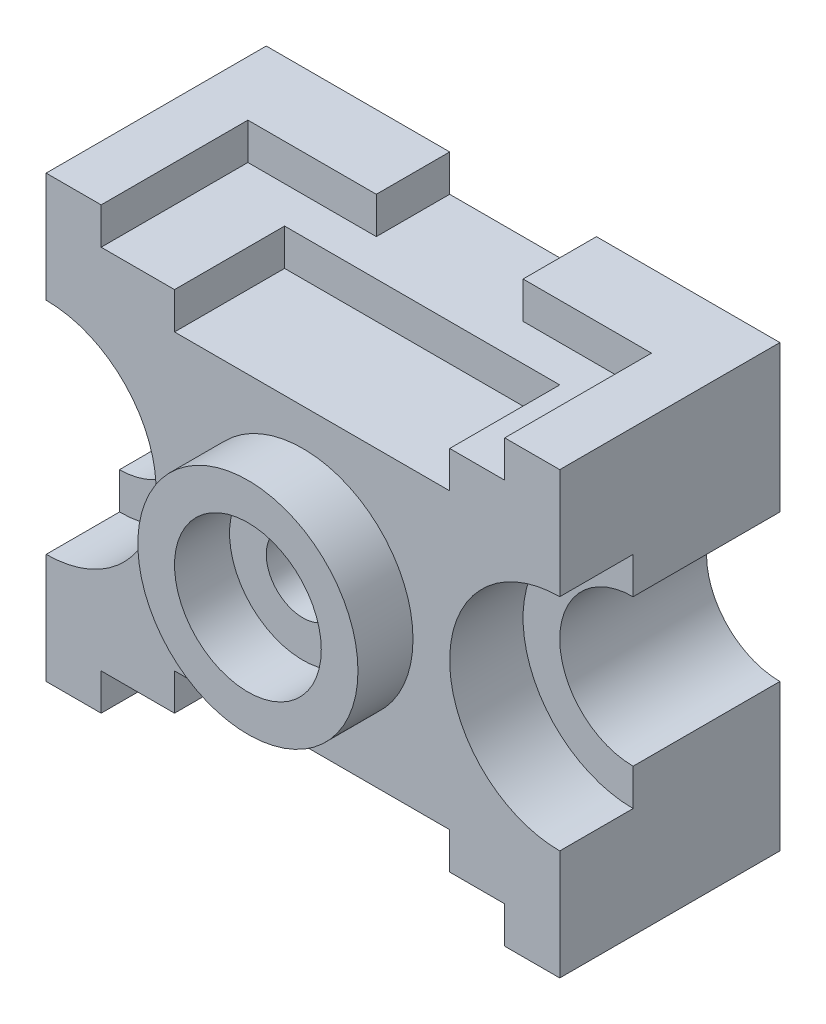
ISO-10303-21;
HEADER;
FILE_DESCRIPTION(('STEP AP214'),'2;1');
FILE_NAME('part.step','',(''),(''),'','','');
FILE_SCHEMA(('AUTOMOTIVE_DESIGN { 1 0 10303 214 1 1 1 1 }'));
ENDSEC;
DATA;
#1=APPLICATION_CONTEXT('core data for automotive mechanical design processes');
#2=APPLICATION_PROTOCOL_DEFINITION('international standard','automotive_design',2000,#1);
#3=PRODUCT_CONTEXT('',#1,'mechanical');
#4=PRODUCT('Part','Part','',(#3));
#5=PRODUCT_RELATED_PRODUCT_CATEGORY('part','',(#4));
#6=PRODUCT_DEFINITION_FORMATION('','',#4);
#7=PRODUCT_DEFINITION_CONTEXT('part definition',#1,'design');
#8=PRODUCT_DEFINITION('design','',#6,#7);
#9=PRODUCT_DEFINITION_SHAPE('','',#8);
#10=(LENGTH_UNIT() NAMED_UNIT(*) SI_UNIT(.MILLI.,.METRE.));
#11=(NAMED_UNIT(*) PLANE_ANGLE_UNIT() SI_UNIT($,.RADIAN.));
#12=(NAMED_UNIT(*) SI_UNIT($,.STERADIAN.) SOLID_ANGLE_UNIT());
#13=UNCERTAINTY_MEASURE_WITH_UNIT(LENGTH_MEASURE(1.E-05),#10,'distance_accuracy_value','');
#14=(GEOMETRIC_REPRESENTATION_CONTEXT(3) GLOBAL_UNCERTAINTY_ASSIGNED_CONTEXT((#13)) GLOBAL_UNIT_ASSIGNED_CONTEXT((#10,
#11,#12)) REPRESENTATION_CONTEXT('',''));
#15=CARTESIAN_POINT('',(0.,0.,0.));
#16=DIRECTION('',(0.,0.,1.));
#17=DIRECTION('',(1.,0.,0.));
#18=AXIS2_PLACEMENT_3D('',#15,#16,#17);
#19=CARTESIAN_POINT('',(55.,55.,0.));
#20=DIRECTION('',(1.,0.,0.));
#21=DIRECTION('',(0.,1.,0.));
#22=AXIS2_PLACEMENT_3D('',#19,#20,#21);
#23=PLANE('',#22);
#24=DIRECTION('',(0.,0.,1.));
#25=VECTOR('',#24,1.);
#26=CARTESIAN_POINT('',(55.,40.,20.));
#27=LINE('',#26,#25);
#28=CARTESIAN_POINT('',(55.,40.,20.));
#29=VERTEX_POINT('',#28);
#30=CARTESIAN_POINT('',(55.,40.,30.));
#31=VERTEX_POINT('',#30);
#32=EDGE_CURVE('E258',#29,#31,#27,.T.);
#33=ORIENTED_EDGE('',*,*,#32,.F.);
#34=DIRECTION('',(0.,1.,0.));
#35=VECTOR('',#34,1.);
#36=CARTESIAN_POINT('',(55.,10.,20.));
#37=LINE('',#36,#35);
#38=CARTESIAN_POINT('',(55.,35.,20.));
#39=VERTEX_POINT('',#38);
#40=EDGE_CURVE('E265',#39,#29,#37,.T.);
#41=ORIENTED_EDGE('',*,*,#40,.F.);
#42=DIRECTION('',(0.,0.,-1.));
#43=VECTOR('',#42,1.);
#44=CARTESIAN_POINT('',(55.,35.,20.));
#45=LINE('',#44,#43);
#46=CARTESIAN_POINT('',(55.,35.,0.));
#47=VERTEX_POINT('',#46);
#48=EDGE_CURVE('E278',#39,#47,#45,.T.);
#49=ORIENTED_EDGE('',*,*,#48,.T.);
#50=DIRECTION('',(0.,1.,0.));
#51=VECTOR('',#50,1.);
#52=CARTESIAN_POINT('',(55.,55.,0.));
#53=LINE('',#52,#51);
#54=CARTESIAN_POINT('',(55.,55.,0.));
#55=VERTEX_POINT('',#54);
#56=EDGE_CURVE('E301',#47,#55,#53,.T.);
#57=ORIENTED_EDGE('',*,*,#56,.T.);
#58=DIRECTION('',(0.,0.,1.));
#59=VECTOR('',#58,1.);
#60=CARTESIAN_POINT('',(55.,55.,0.));
#61=LINE('',#60,#59);
#62=CARTESIAN_POINT('',(55.,55.,30.));
#63=VERTEX_POINT('',#62);
#64=EDGE_CURVE('E309',#55,#63,#61,.T.);
#65=ORIENTED_EDGE('',*,*,#64,.T.);
#66=DIRECTION('',(0.,1.,0.));
#67=VECTOR('',#66,1.);
#68=CARTESIAN_POINT('',(55.,55.,30.));
#69=LINE('',#68,#67);
#70=EDGE_CURVE('E297',#31,#63,#69,.T.);
#71=ORIENTED_EDGE('',*,*,#70,.F.);
#72=EDGE_LOOP('',(#33,#41,#49,#57,#65,#71));
#73=FACE_BOUND('',#72,.T.);
#74=ADVANCED_FACE('F33',(#73),#23,.T.);
#75=CARTESIAN_POINT('',(0.,50.,30.));
#76=DIRECTION('',(0.,-1.,0.));
#77=DIRECTION('',(0.,0.,-1.));
#78=AXIS2_PLACEMENT_3D('',#75,#76,#77);
#79=PLANE('',#78);
#80=DIRECTION('',(1.,0.,0.));
#81=VECTOR('',#80,1.);
#82=CARTESIAN_POINT('',(30.,50.,10.));
#83=LINE('',#82,#81);
#84=CARTESIAN_POINT('',(30.,50.,10.));
#85=VERTEX_POINT('',#84);
#86=CARTESIAN_POINT('',(47.5,50.,10.));
#87=VERTEX_POINT('',#86);
#88=EDGE_CURVE('E281',#85,#87,#83,.T.);
#89=ORIENTED_EDGE('',*,*,#88,.F.);
#90=DIRECTION('',(0.,0.,1.));
#91=VECTOR('',#90,1.);
#92=CARTESIAN_POINT('',(30.,50.,0.));
#93=LINE('',#92,#91);
#94=CARTESIAN_POINT('',(30.,50.,0.));
#95=VERTEX_POINT('',#94);
#96=EDGE_CURVE('E287',#95,#85,#93,.T.);
#97=ORIENTED_EDGE('',*,*,#96,.F.);
#98=DIRECTION('',(1.,0.,0.));
#99=VECTOR('',#98,1.);
#100=CARTESIAN_POINT('',(0.,50.,0.));
#101=LINE('',#100,#99);
#102=CARTESIAN_POINT('',(9.99999999999999,50.,0.));
#103=VERTEX_POINT('',#102);
#104=EDGE_CURVE('E427',#103,#95,#101,.T.);
#105=ORIENTED_EDGE('',*,*,#104,.F.);
#106=DIRECTION('',(0.,0.,-1.));
#107=VECTOR('',#106,1.);
#108=CARTESIAN_POINT('',(9.99999999999999,50.,0.));
#109=LINE('',#108,#107);
#110=CARTESIAN_POINT('',(10.,50.,10.));
#111=VERTEX_POINT('',#110);
#112=EDGE_CURVE('E460',#111,#103,#109,.T.);
#113=ORIENTED_EDGE('',*,*,#112,.F.);
#114=DIRECTION('',(1.,0.,0.));
#115=VECTOR('',#114,1.);
#116=CARTESIAN_POINT('',(10.,50.,10.));
#117=LINE('',#116,#115);
#118=CARTESIAN_POINT('',(-7.50000000000001,50.,10.));
#119=VERTEX_POINT('',#118);
#120=EDGE_CURVE('E456',#119,#111,#117,.T.);
#121=ORIENTED_EDGE('',*,*,#120,.F.);
#122=DIRECTION('',(0.,0.,-1.));
#123=VECTOR('',#122,1.);
#124=CARTESIAN_POINT('',(-7.50000000000001,50.,30.));
#125=LINE('',#124,#123);
#126=CARTESIAN_POINT('',(-7.50000000000001,50.,30.));
#127=VERTEX_POINT('',#126);
#128=EDGE_CURVE('E518',#127,#119,#125,.T.);
#129=ORIENTED_EDGE('',*,*,#128,.F.);
#130=DIRECTION('',(-1.,0.,0.));
#131=VECTOR('',#130,1.);
#132=CARTESIAN_POINT('',(0.,50.,30.));
#133=LINE('',#132,#131);
#134=CARTESIAN_POINT('',(2.50000000000001,50.,30.));
#135=VERTEX_POINT('',#134);
#136=EDGE_CURVE('E450',#135,#127,#133,.T.);
#137=ORIENTED_EDGE('',*,*,#136,.F.);
#138=DIRECTION('',(0.,0.,1.));
#139=VECTOR('',#138,1.);
#140=CARTESIAN_POINT('',(2.50000000000001,50.,15.));
#141=LINE('',#140,#139);
#142=CARTESIAN_POINT('',(2.50000000000001,50.,15.));
#143=VERTEX_POINT('',#142);
#144=EDGE_CURVE('E433',#143,#135,#141,.T.);
#145=ORIENTED_EDGE('',*,*,#144,.F.);
#146=DIRECTION('',(-1.,0.,0.));
#147=VECTOR('',#146,1.);
#148=CARTESIAN_POINT('',(40.,50.,15.));
#149=LINE('',#148,#147);
#150=CARTESIAN_POINT('',(40.,50.,15.));
#151=VERTEX_POINT('',#150);
#152=EDGE_CURVE('E413',#151,#143,#149,.T.);
#153=ORIENTED_EDGE('',*,*,#152,.F.);
#154=DIRECTION('',(0.,0.,1.));
#155=VECTOR('',#154,1.);
#156=CARTESIAN_POINT('',(40.,50.,0.));
#157=LINE('',#156,#155);
#158=CARTESIAN_POINT('',(40.,50.,30.));
#159=VERTEX_POINT('',#158);
#160=EDGE_CURVE('E339',#151,#159,#157,.T.);
#161=ORIENTED_EDGE('',*,*,#160,.T.);
#162=DIRECTION('',(-1.,0.,0.));
#163=VECTOR('',#162,1.);
#164=CARTESIAN_POINT('',(40.,50.,30.));
#165=LINE('',#164,#163);
#166=CARTESIAN_POINT('',(47.5,50.,30.));
#167=VERTEX_POINT('',#166);
#168=EDGE_CURVE('E318',#167,#159,#165,.T.);
#169=ORIENTED_EDGE('',*,*,#168,.F.);
#170=DIRECTION('',(0.,0.,1.));
#171=VECTOR('',#170,1.);
#172=CARTESIAN_POINT('',(47.5,50.,0.));
#173=LINE('',#172,#171);
#174=EDGE_CURVE('E337',#87,#167,#173,.T.);
#175=ORIENTED_EDGE('',*,*,#174,.F.);
#176=EDGE_LOOP('',(#89,#97,#105,#113,#121,#129,#137,#145,#153,#161,#169,#175));
#177=FACE_BOUND('',#176,.T.);
#178=ADVANCED_FACE('F448',(#177),#79,.F.);
#179=CARTESIAN_POINT('',(47.5,50.,0.));
#180=DIRECTION('',(-1.,0.,0.));
#181=DIRECTION('',(0.,0.,1.));
#182=AXIS2_PLACEMENT_3D('',#179,#180,#181);
#183=PLANE('',#182);
#184=DIRECTION('',(0.,0.,1.));
#185=VECTOR('',#184,1.);
#186=CARTESIAN_POINT('',(47.5,55.,0.));
#187=LINE('',#186,#185);
#188=CARTESIAN_POINT('',(47.5,55.,10.));
#189=VERTEX_POINT('',#188);
#190=CARTESIAN_POINT('',(47.5,55.,30.));
#191=VERTEX_POINT('',#190);
#192=EDGE_CURVE('E335',#189,#191,#187,.T.);
#193=ORIENTED_EDGE('',*,*,#192,.F.);
#194=DIRECTION('',(0.,-1.,0.));
#195=VECTOR('',#194,1.);
#196=CARTESIAN_POINT('',(47.5,55.,10.));
#197=LINE('',#196,#195);
#198=EDGE_CURVE('E50',#189,#87,#197,.T.);
#199=ORIENTED_EDGE('',*,*,#198,.T.);
#200=ORIENTED_EDGE('',*,*,#174,.T.);
#201=DIRECTION('',(0.,-1.,0.));
#202=VECTOR('',#201,1.);
#203=CARTESIAN_POINT('',(47.5,50.,30.));
#204=LINE('',#203,#202);
#205=EDGE_CURVE('E315',#191,#167,#204,.T.);
#206=ORIENTED_EDGE('',*,*,#205,.F.);
#207=EDGE_LOOP('',(#193,#199,#200,#206));
#208=FACE_BOUND('',#207,.T.);
#209=ADVANCED_FACE('F612',(#208),#183,.T.);
#210=CARTESIAN_POINT('',(0.,0.,30.));
#211=DIRECTION('',(0.,0.,1.));
#212=DIRECTION('',(1.,0.,0.));
#213=AXIS2_PLACEMENT_3D('',#210,#211,#212);
#214=PLANE('',#213);
#215=CARTESIAN_POINT('',(55.,25.,30.));
#216=DIRECTION('',(0.,0.,1.));
#217=DIRECTION('',(1.,0.,0.));
#218=AXIS2_PLACEMENT_3D('',#215,#216,#217);
#219=CIRCLE('',#218,15.);
#220=CARTESIAN_POINT('',(55.,10.,30.));
#221=VERTEX_POINT('',#220);
#222=EDGE_CURVE('E253',#31,#221,#219,.T.);
#223=ORIENTED_EDGE('',*,*,#222,.F.);
#224=ORIENTED_EDGE('',*,*,#70,.T.);
#225=DIRECTION('',(-1.,0.,0.));
#226=VECTOR('',#225,1.);
#227=CARTESIAN_POINT('',(47.5,55.,30.));
#228=LINE('',#227,#226);
#229=EDGE_CURVE('E312',#63,#191,#228,.T.);
#230=ORIENTED_EDGE('',*,*,#229,.T.);
#231=ORIENTED_EDGE('',*,*,#205,.T.);
#232=ORIENTED_EDGE('',*,*,#168,.T.);
#233=DIRECTION('',(0.,-1.,0.));
#234=VECTOR('',#233,1.);
#235=CARTESIAN_POINT('',(40.,0.,30.));
#236=LINE('',#235,#234);
#237=CARTESIAN_POINT('',(40.,45.,30.));
#238=VERTEX_POINT('',#237);
#239=EDGE_CURVE('E330',#159,#238,#236,.T.);
#240=ORIENTED_EDGE('',*,*,#239,.T.);
#241=DIRECTION('',(1.,0.,0.));
#242=VECTOR('',#241,1.);
#243=CARTESIAN_POINT('',(2.50000000000001,45.,30.));
#244=LINE('',#243,#242);
#245=CARTESIAN_POINT('',(2.50000000000001,45.,30.));
#246=VERTEX_POINT('',#245);
#247=EDGE_CURVE('E418',#246,#238,#244,.T.);
#248=ORIENTED_EDGE('',*,*,#247,.F.);
#249=DIRECTION('',(0.,-1.,0.));
#250=VECTOR('',#249,1.);
#251=CARTESIAN_POINT('',(2.50000000000001,50.,30.));
#252=LINE('',#251,#250);
#253=EDGE_CURVE('E407',#135,#246,#252,.T.);
#254=ORIENTED_EDGE('',*,*,#253,.F.);
#255=ORIENTED_EDGE('',*,*,#136,.T.);
#256=DIRECTION('',(0.,1.,0.));
#257=VECTOR('',#256,1.);
#258=CARTESIAN_POINT('',(-7.50000000000001,50.,30.));
#259=LINE('',#258,#257);
#260=CARTESIAN_POINT('',(-7.50000000000001,55.,30.));
#261=VERTEX_POINT('',#260);
#262=EDGE_CURVE('E497',#127,#261,#259,.T.);
#263=ORIENTED_EDGE('',*,*,#262,.T.);
#264=DIRECTION('',(-1.,0.,0.));
#265=VECTOR('',#264,1.);
#266=CARTESIAN_POINT('',(-7.50000000000001,55.,30.));
#267=LINE('',#266,#265);
#268=CARTESIAN_POINT('',(-15.,55.,30.));
#269=VERTEX_POINT('',#268);
#270=EDGE_CURVE('E499',#261,#269,#267,.T.);
#271=ORIENTED_EDGE('',*,*,#270,.T.);
#272=DIRECTION('',(0.,-1.,0.));
#273=VECTOR('',#272,1.);
#274=CARTESIAN_POINT('',(-15.,55.,30.));
#275=LINE('',#274,#273);
#276=CARTESIAN_POINT('',(-15.,40.,30.));
#277=VERTEX_POINT('',#276);
#278=EDGE_CURVE('E485',#269,#277,#275,.T.);
#279=ORIENTED_EDGE('',*,*,#278,.T.);
#280=CARTESIAN_POINT('',(-15.,25.,30.));
#281=DIRECTION('',(0.,0.,1.));
#282=DIRECTION('',(-1.,0.,0.));
#283=AXIS2_PLACEMENT_3D('',#280,#281,#282);
#284=CIRCLE('',#283,15.);
#285=CARTESIAN_POINT('',(-15.,10.,30.));
#286=VERTEX_POINT('',#285);
#287=EDGE_CURVE('E365',#286,#277,#284,.T.);
#288=ORIENTED_EDGE('',*,*,#287,.F.);
#289=CARTESIAN_POINT('',(-15.,-5.,30.));
#290=VERTEX_POINT('',#289);
#291=EDGE_CURVE('E489',#286,#290,#275,.T.);
#292=ORIENTED_EDGE('',*,*,#291,.T.);
#293=DIRECTION('',(1.,0.,0.));
#294=VECTOR('',#293,1.);
#295=CARTESIAN_POINT('',(-15.,-5.,30.));
#296=LINE('',#295,#294);
#297=CARTESIAN_POINT('',(-7.5,-5.,30.));
#298=VERTEX_POINT('',#297);
#299=EDGE_CURVE('E488',#290,#298,#296,.T.);
#300=ORIENTED_EDGE('',*,*,#299,.T.);
#301=DIRECTION('',(0.,1.,0.));
#302=VECTOR('',#301,1.);
#303=CARTESIAN_POINT('',(-7.5,-5.,30.));
#304=LINE('',#303,#302);
#305=CARTESIAN_POINT('',(-7.5,0.,30.));
#306=VERTEX_POINT('',#305);
#307=EDGE_CURVE('E491',#298,#306,#304,.T.);
#308=ORIENTED_EDGE('',*,*,#307,.T.);
#309=DIRECTION('',(1.,0.,0.));
#310=VECTOR('',#309,1.);
#311=CARTESIAN_POINT('',(-7.5,0.,30.));
#312=LINE('',#311,#310);
#313=CARTESIAN_POINT('',(2.50000000000001,0.,30.));
#314=VERTEX_POINT('',#313);
#315=EDGE_CURVE('E493',#306,#314,#312,.T.);
#316=ORIENTED_EDGE('',*,*,#315,.T.);
#317=DIRECTION('',(0.,-1.,0.));
#318=VECTOR('',#317,1.);
#319=CARTESIAN_POINT('',(2.50000000000001,0.,30.));
#320=LINE('',#319,#318);
#321=CARTESIAN_POINT('',(2.50000000000001,5.,30.));
#322=VERTEX_POINT('',#321);
#323=EDGE_CURVE('E397',#322,#314,#320,.T.);
#324=ORIENTED_EDGE('',*,*,#323,.F.);
#325=DIRECTION('',(-1.,0.,0.));
#326=VECTOR('',#325,1.);
#327=CARTESIAN_POINT('',(2.50000000000001,5.,30.));
#328=LINE('',#327,#326);
#329=CARTESIAN_POINT('',(40.,5.,30.));
#330=VERTEX_POINT('',#329);
#331=EDGE_CURVE('E378',#330,#322,#328,.T.);
#332=ORIENTED_EDGE('',*,*,#331,.F.);
#333=CARTESIAN_POINT('',(40.,0.,30.));
#334=VERTEX_POINT('',#333);
#335=EDGE_CURVE('E321',#330,#334,#236,.T.);
#336=ORIENTED_EDGE('',*,*,#335,.T.);
#337=DIRECTION('',(1.,0.,0.));
#338=VECTOR('',#337,1.);
#339=CARTESIAN_POINT('',(47.5,0.,30.));
#340=LINE('',#339,#338);
#341=CARTESIAN_POINT('',(47.5,0.,30.));
#342=VERTEX_POINT('',#341);
#343=EDGE_CURVE('E324',#334,#342,#340,.T.);
#344=ORIENTED_EDGE('',*,*,#343,.T.);
#345=DIRECTION('',(0.,-1.,0.));
#346=VECTOR('',#345,1.);
#347=CARTESIAN_POINT('',(47.5,-5.,30.));
#348=LINE('',#347,#346);
#349=CARTESIAN_POINT('',(47.5,-5.,30.));
#350=VERTEX_POINT('',#349);
#351=EDGE_CURVE('E550',#342,#350,#348,.T.);
#352=ORIENTED_EDGE('',*,*,#351,.T.);
#353=DIRECTION('',(1.,0.,0.));
#354=VECTOR('',#353,1.);
#355=CARTESIAN_POINT('',(55.,-5.,30.));
#356=LINE('',#355,#354);
#357=CARTESIAN_POINT('',(55.,-5.,30.));
#358=VERTEX_POINT('',#357);
#359=EDGE_CURVE('E556',#350,#358,#356,.T.);
#360=ORIENTED_EDGE('',*,*,#359,.T.);
#361=EDGE_CURVE('E310',#358,#221,#69,.T.);
#362=ORIENTED_EDGE('',*,*,#361,.T.);
#363=EDGE_LOOP('',(#223,#224,#230,#231,#232,#240,#248,#254,#255,#263,#271,#279,#288,#292,#300,
#308,#316,#324,#332,#336,#344,#352,#360,#362));
#364=FACE_BOUND('',#363,.T.);
#365=CARTESIAN_POINT('',(20.,25.,30.));
#366=DIRECTION('',(0.,0.,1.));
#367=DIRECTION('',(1.,0.,0.));
#368=AXIS2_PLACEMENT_3D('',#365,#366,#367);
#369=CIRCLE('',#368,15.);
#370=CARTESIAN_POINT('',(35.,25.,30.));
#371=VERTEX_POINT('',#370);
#372=EDGE_CURVE('E359',#371,#371,#369,.T.);
#373=ORIENTED_EDGE('',*,*,#372,.F.);
#374=EDGE_LOOP('',(#373));
#375=FACE_BOUND('',#374,.T.);
#376=ADVANCED_FACE('F561',(#364,#375),#214,.T.);
#377=CARTESIAN_POINT('',(-15.,55.,30.));
#378=DIRECTION('',(1.,0.,0.));
#379=DIRECTION('',(0.,1.,0.));
#380=AXIS2_PLACEMENT_3D('',#377,#378,#379);
#381=PLANE('',#380);
#382=ORIENTED_EDGE('',*,*,#291,.F.);
#383=DIRECTION('',(0.,0.,1.));
#384=VECTOR('',#383,1.);
#385=CARTESIAN_POINT('',(-15.,10.,20.));
#386=LINE('',#385,#384);
#387=CARTESIAN_POINT('',(-15.,10.,20.));
#388=VERTEX_POINT('',#387);
#389=EDGE_CURVE('E376',#388,#286,#386,.T.);
#390=ORIENTED_EDGE('',*,*,#389,.F.);
#391=DIRECTION('',(0.,-1.,0.));
#392=VECTOR('',#391,1.);
#393=CARTESIAN_POINT('',(-15.,10.,20.));
#394=LINE('',#393,#392);
#395=CARTESIAN_POINT('',(-15.,15.,20.));
#396=VERTEX_POINT('',#395);
#397=EDGE_CURVE('E371',#396,#388,#394,.T.);
#398=ORIENTED_EDGE('',*,*,#397,.F.);
#399=DIRECTION('',(0.,0.,-1.));
#400=VECTOR('',#399,1.);
#401=CARTESIAN_POINT('',(-15.,15.,20.));
#402=LINE('',#401,#400);
#403=CARTESIAN_POINT('',(-15.,15.,0.));
#404=VERTEX_POINT('',#403);
#405=EDGE_CURVE('E478',#396,#404,#402,.T.);
#406=ORIENTED_EDGE('',*,*,#405,.T.);
#407=DIRECTION('',(0.,-1.,0.));
#408=VECTOR('',#407,1.);
#409=CARTESIAN_POINT('',(-15.,55.,0.));
#410=LINE('',#409,#408);
#411=CARTESIAN_POINT('',(-15.,-5.,0.));
#412=VERTEX_POINT('',#411);
#413=EDGE_CURVE('E482',#404,#412,#410,.T.);
#414=ORIENTED_EDGE('',*,*,#413,.T.);
#415=DIRECTION('',(0.,0.,-1.));
#416=VECTOR('',#415,1.);
#417=CARTESIAN_POINT('',(-15.,-5.,30.));
#418=LINE('',#417,#416);
#419=EDGE_CURVE('E11',#290,#412,#418,.T.);
#420=ORIENTED_EDGE('',*,*,#419,.F.);
#421=EDGE_LOOP('',(#382,#390,#398,#406,#414,#420));
#422=FACE_BOUND('',#421,.T.);
#423=ADVANCED_FACE('F577',(#422),#381,.F.);
#424=CARTESIAN_POINT('',(-7.50000000000001,50.,30.));
#425=DIRECTION('',(-1.,0.,0.));
#426=DIRECTION('',(0.,0.,1.));
#427=AXIS2_PLACEMENT_3D('',#424,#425,#426);
#428=PLANE('',#427);
#429=DIRECTION('',(0.,-1.,0.));
#430=VECTOR('',#429,1.);
#431=CARTESIAN_POINT('',(-7.50000000000001,55.,10.));
#432=LINE('',#431,#430);
#433=CARTESIAN_POINT('',(-7.50000000000001,55.,10.));
#434=VERTEX_POINT('',#433);
#435=EDGE_CURVE('E472',#434,#119,#432,.T.);
#436=ORIENTED_EDGE('',*,*,#435,.F.);
#437=DIRECTION('',(0.,0.,-1.));
#438=VECTOR('',#437,1.);
#439=CARTESIAN_POINT('',(-7.50000000000001,55.,30.));
#440=LINE('',#439,#438);
#441=EDGE_CURVE('E515',#261,#434,#440,.T.);
#442=ORIENTED_EDGE('',*,*,#441,.F.);
#443=ORIENTED_EDGE('',*,*,#262,.F.);
#444=ORIENTED_EDGE('',*,*,#128,.T.);
#445=EDGE_LOOP('',(#436,#442,#443,#444));
#446=FACE_BOUND('',#445,.T.);
#447=ADVANCED_FACE('F831',(#446),#428,.F.);
#448=CARTESIAN_POINT('',(-15.,40.,20.));
#449=VERTEX_POINT('',#448);
#450=CARTESIAN_POINT('',(-15.,35.,20.));
#451=VERTEX_POINT('',#450);
#452=EDGE_CURVE('E372',#449,#451,#394,.T.);
#453=ORIENTED_EDGE('',*,*,#452,.F.);
#454=DIRECTION('',(0.,0.,1.));
#455=VECTOR('',#454,1.);
#456=CARTESIAN_POINT('',(-15.,40.,20.));
#457=LINE('',#456,#455);
#458=EDGE_CURVE('E374',#449,#277,#457,.T.);
#459=ORIENTED_EDGE('',*,*,#458,.T.);
#460=ORIENTED_EDGE('',*,*,#278,.F.);
#461=DIRECTION('',(0.,0.,-1.));
#462=VECTOR('',#461,1.);
#463=CARTESIAN_POINT('',(-15.,55.,30.));
#464=LINE('',#463,#462);
#465=CARTESIAN_POINT('',(-15.,55.,0.));
#466=VERTEX_POINT('',#465);
#467=EDGE_CURVE('E501',#269,#466,#464,.T.);
#468=ORIENTED_EDGE('',*,*,#467,.T.);
#469=CARTESIAN_POINT('',(-15.,35.,0.));
#470=VERTEX_POINT('',#469);
#471=EDGE_CURVE('E502',#466,#470,#410,.T.);
#472=ORIENTED_EDGE('',*,*,#471,.T.);
#473=DIRECTION('',(0.,0.,-1.));
#474=VECTOR('',#473,1.);
#475=CARTESIAN_POINT('',(-15.,35.,20.));
#476=LINE('',#475,#474);
#477=EDGE_CURVE('E480',#451,#470,#476,.T.);
#478=ORIENTED_EDGE('',*,*,#477,.F.);
#479=EDGE_LOOP('',(#453,#459,#460,#468,#472,#478));
#480=FACE_BOUND('',#479,.T.);
#481=ADVANCED_FACE('F35',(#480),#381,.F.);
#482=CARTESIAN_POINT('',(-15.,-5.,30.));
#483=DIRECTION('',(0.,1.,0.));
#484=DIRECTION('',(0.,0.,1.));
#485=AXIS2_PLACEMENT_3D('',#482,#483,#484);
#486=PLANE('',#485);
#487=DIRECTION('',(1.,0.,0.));
#488=VECTOR('',#487,1.);
#489=CARTESIAN_POINT('',(-15.,-5.,0.));
#490=LINE('',#489,#488);
#491=CARTESIAN_POINT('',(-7.5,-5.,0.));
#492=VERTEX_POINT('',#491);
#493=EDGE_CURVE('E505',#412,#492,#490,.T.);
#494=ORIENTED_EDGE('',*,*,#493,.T.);
#495=DIRECTION('',(0.,0.,-1.));
#496=VECTOR('',#495,1.);
#497=CARTESIAN_POINT('',(-7.5,-5.,30.));
#498=LINE('',#497,#496);
#499=EDGE_CURVE('E42',#298,#492,#498,.T.);
#500=ORIENTED_EDGE('',*,*,#499,.F.);
#501=ORIENTED_EDGE('',*,*,#299,.F.);
#502=ORIENTED_EDGE('',*,*,#419,.T.);
#503=EDGE_LOOP('',(#494,#500,#501,#502));
#504=FACE_BOUND('',#503,.T.);
#505=ADVANCED_FACE('F575',(#504),#486,.F.);
#506=CARTESIAN_POINT('',(-7.5,-5.,30.));
#507=DIRECTION('',(-1.,0.,0.));
#508=DIRECTION('',(0.,0.,1.));
#509=AXIS2_PLACEMENT_3D('',#506,#507,#508);
#510=PLANE('',#509);
#511=DIRECTION('',(0.,1.,0.));
#512=VECTOR('',#511,1.);
#513=CARTESIAN_POINT('',(-7.5,-5.,0.));
#514=LINE('',#513,#512);
#515=CARTESIAN_POINT('',(-7.5,0.,0.));
#516=VERTEX_POINT('',#515);
#517=EDGE_CURVE('E507',#492,#516,#514,.T.);
#518=ORIENTED_EDGE('',*,*,#517,.T.);
#519=DIRECTION('',(0.,0.,-1.));
#520=VECTOR('',#519,1.);
#521=CARTESIAN_POINT('',(-7.5,0.,30.));
#522=LINE('',#521,#520);
#523=EDGE_CURVE('E521',#306,#516,#522,.T.);
#524=ORIENTED_EDGE('',*,*,#523,.F.);
#525=ORIENTED_EDGE('',*,*,#307,.F.);
#526=ORIENTED_EDGE('',*,*,#499,.T.);
#527=EDGE_LOOP('',(#518,#524,#525,#526));
#528=FACE_BOUND('',#527,.T.);
#529=ADVANCED_FACE('F528',(#528),#510,.F.);
#530=CARTESIAN_POINT('',(-7.5,0.,30.));
#531=DIRECTION('',(0.,1.,0.));
#532=DIRECTION('',(0.,0.,1.));
#533=AXIS2_PLACEMENT_3D('',#530,#531,#532);
#534=PLANE('',#533);
#535=DIRECTION('',(1.,0.,0.));
#536=VECTOR('',#535,1.);
#537=CARTESIAN_POINT('',(40.,0.,15.));
#538=LINE('',#537,#536);
#539=CARTESIAN_POINT('',(2.50000000000001,0.,15.));
#540=VERTEX_POINT('',#539);
#541=CARTESIAN_POINT('',(40.,0.,15.));
#542=VERTEX_POINT('',#541);
#543=EDGE_CURVE('E58',#540,#542,#538,.T.);
#544=ORIENTED_EDGE('',*,*,#543,.F.);
#545=DIRECTION('',(0.,0.,1.));
#546=VECTOR('',#545,1.);
#547=CARTESIAN_POINT('',(2.50000000000001,0.,15.));
#548=LINE('',#547,#546);
#549=EDGE_CURVE('E405',#540,#314,#548,.T.);
#550=ORIENTED_EDGE('',*,*,#549,.T.);
#551=ORIENTED_EDGE('',*,*,#315,.F.);
#552=ORIENTED_EDGE('',*,*,#523,.T.);
#553=DIRECTION('',(1.,0.,0.));
#554=VECTOR('',#553,1.);
#555=CARTESIAN_POINT('',(-7.5,0.,0.));
#556=LINE('',#555,#554);
#557=CARTESIAN_POINT('',(47.5,0.,0.));
#558=VERTEX_POINT('',#557);
#559=EDGE_CURVE('E509',#516,#558,#556,.T.);
#560=ORIENTED_EDGE('',*,*,#559,.T.);
#561=DIRECTION('',(0.,0.,1.));
#562=VECTOR('',#561,1.);
#563=CARTESIAN_POINT('',(47.5,0.,0.));
#564=LINE('',#563,#562);
#565=EDGE_CURVE('E347',#558,#342,#564,.T.);
#566=ORIENTED_EDGE('',*,*,#565,.T.);
#567=ORIENTED_EDGE('',*,*,#343,.F.);
#568=DIRECTION('',(0.,0.,1.));
#569=VECTOR('',#568,1.);
#570=CARTESIAN_POINT('',(40.,0.,0.));
#571=LINE('',#570,#569);
#572=EDGE_CURVE('E345',#542,#334,#571,.T.);
#573=ORIENTED_EDGE('',*,*,#572,.F.);
#574=EDGE_LOOP('',(#544,#550,#551,#552,#560,#566,#567,#573));
#575=FACE_BOUND('',#574,.T.);
#576=ADVANCED_FACE('F543',(#575),#534,.F.);
#577=CARTESIAN_POINT('',(-7.50000000000001,55.,30.));
#578=DIRECTION('',(0.,-1.,0.));
#579=DIRECTION('',(0.,0.,-1.));
#580=AXIS2_PLACEMENT_3D('',#577,#578,#579);
#581=PLANE('',#580);
#582=DIRECTION('',(-1.,0.,0.));
#583=VECTOR('',#582,1.);
#584=CARTESIAN_POINT('',(-7.50000000000001,55.,0.));
#585=LINE('',#584,#583);
#586=CARTESIAN_POINT('',(9.99999999999999,55.,0.));
#587=VERTEX_POINT('',#586);
#588=EDGE_CURVE('E511',#587,#466,#585,.T.);
#589=ORIENTED_EDGE('',*,*,#588,.T.);
#590=ORIENTED_EDGE('',*,*,#467,.F.);
#591=ORIENTED_EDGE('',*,*,#270,.F.);
#592=ORIENTED_EDGE('',*,*,#441,.T.);
#593=DIRECTION('',(1.,0.,0.));
#594=VECTOR('',#593,1.);
#595=CARTESIAN_POINT('',(10.,55.,10.));
#596=LINE('',#595,#594);
#597=CARTESIAN_POINT('',(10.,55.,10.));
#598=VERTEX_POINT('',#597);
#599=EDGE_CURVE('E457',#434,#598,#596,.T.);
#600=ORIENTED_EDGE('',*,*,#599,.T.);
#601=DIRECTION('',(0.,0.,-1.));
#602=VECTOR('',#601,1.);
#603=CARTESIAN_POINT('',(9.99999999999999,55.,0.));
#604=LINE('',#603,#602);
#605=EDGE_CURVE('E459',#598,#587,#604,.T.);
#606=ORIENTED_EDGE('',*,*,#605,.T.);
#607=EDGE_LOOP('',(#589,#590,#591,#592,#600,#606));
#608=FACE_BOUND('',#607,.T.);
#609=ADVANCED_FACE('F591',(#608),#581,.F.);
#610=CARTESIAN_POINT('',(0.,0.,0.));
#611=DIRECTION('',(0.,0.,1.));
#612=DIRECTION('',(1.,0.,0.));
#613=AXIS2_PLACEMENT_3D('',#610,#611,#612);
#614=PLANE('',#613);
#615=ORIENTED_EDGE('',*,*,#56,.F.);
#616=CARTESIAN_POINT('',(55.,25.,0.));
#617=DIRECTION('',(0.,0.,-1.));
#618=DIRECTION('',(1.,0.,0.));
#619=AXIS2_PLACEMENT_3D('',#616,#617,#618);
#620=CIRCLE('',#619,9.99999999999999);
#621=CARTESIAN_POINT('',(55.,15.,0.));
#622=VERTEX_POINT('',#621);
#623=EDGE_CURVE('E274',#622,#47,#620,.T.);
#624=ORIENTED_EDGE('',*,*,#623,.F.);
#625=CARTESIAN_POINT('',(55.,-5.,0.));
#626=VERTEX_POINT('',#625);
#627=EDGE_CURVE('E298',#626,#622,#53,.T.);
#628=ORIENTED_EDGE('',*,*,#627,.F.);
#629=DIRECTION('',(1.,0.,0.));
#630=VECTOR('',#629,1.);
#631=CARTESIAN_POINT('',(55.,-5.,0.));
#632=LINE('',#631,#630);
#633=CARTESIAN_POINT('',(47.5,-5.,0.));
#634=VERTEX_POINT('',#633);
#635=EDGE_CURVE('E306',#634,#626,#632,.T.);
#636=ORIENTED_EDGE('',*,*,#635,.F.);
#637=DIRECTION('',(0.,-1.,0.));
#638=VECTOR('',#637,1.);
#639=CARTESIAN_POINT('',(47.5,-5.,0.));
#640=LINE('',#639,#638);
#641=EDGE_CURVE('E303',#558,#634,#640,.T.);
#642=ORIENTED_EDGE('',*,*,#641,.F.);
#643=ORIENTED_EDGE('',*,*,#559,.F.);
#644=ORIENTED_EDGE('',*,*,#517,.F.);
#645=ORIENTED_EDGE('',*,*,#493,.F.);
#646=ORIENTED_EDGE('',*,*,#413,.F.);
#647=CARTESIAN_POINT('',(-15.,25.,0.));
#648=DIRECTION('',(0.,0.,-1.));
#649=DIRECTION('',(-1.,0.,0.));
#650=AXIS2_PLACEMENT_3D('',#647,#648,#649);
#651=CIRCLE('',#650,10.);
#652=EDGE_CURVE('E475',#470,#404,#651,.T.);
#653=ORIENTED_EDGE('',*,*,#652,.F.);
#654=ORIENTED_EDGE('',*,*,#471,.F.);
#655=ORIENTED_EDGE('',*,*,#588,.F.);
#656=DIRECTION('',(0.,-1.,0.));
#657=VECTOR('',#656,1.);
#658=CARTESIAN_POINT('',(9.99999999999999,55.,0.));
#659=LINE('',#658,#657);
#660=EDGE_CURVE('E463',#587,#103,#659,.T.);
#661=ORIENTED_EDGE('',*,*,#660,.T.);
#662=ORIENTED_EDGE('',*,*,#104,.T.);
#663=DIRECTION('',(0.,-1.,0.));
#664=VECTOR('',#663,1.);
#665=CARTESIAN_POINT('',(30.,55.,0.));
#666=LINE('',#665,#664);
#667=CARTESIAN_POINT('',(30.,55.,0.));
#668=VERTEX_POINT('',#667);
#669=EDGE_CURVE('E294',#668,#95,#666,.T.);
#670=ORIENTED_EDGE('',*,*,#669,.F.);
#671=DIRECTION('',(-1.,0.,0.));
#672=VECTOR('',#671,1.);
#673=CARTESIAN_POINT('',(47.5,55.,0.));
#674=LINE('',#673,#672);
#675=EDGE_CURVE('E300',#55,#668,#674,.T.);
#676=ORIENTED_EDGE('',*,*,#675,.F.);
#677=EDGE_LOOP('',(#615,#624,#628,#636,#642,#643,#644,#645,#646,#653,#654,#655,#661,#662,#670,#676));
#678=FACE_BOUND('',#677,.T.);
#679=CARTESIAN_POINT('',(20.,25.,0.));
#680=DIRECTION('',(0.,0.,1.));
#681=DIRECTION('',(1.,0.,0.));
#682=AXIS2_PLACEMENT_3D('',#679,#680,#681);
#683=CIRCLE('',#682,5.);
#684=CARTESIAN_POINT('',(25.,25.,0.));
#685=VERTEX_POINT('',#684);
#686=EDGE_CURVE('E351',#685,#685,#683,.T.);
#687=ORIENTED_EDGE('',*,*,#686,.T.);
#688=EDGE_LOOP('',(#687));
#689=FACE_BOUND('',#688,.T.);
#690=ADVANCED_FACE('F536',(#678,#689),#614,.F.);
#691=CARTESIAN_POINT('',(-15.,25.,20.));
#692=DIRECTION('',(0.,0.,-1.));
#693=DIRECTION('',(-1.,0.,0.));
#694=AXIS2_PLACEMENT_3D('',#691,#692,#693);
#695=CYLINDRICAL_SURFACE('',#694,10.);
#696=ORIENTED_EDGE('',*,*,#652,.T.);
#697=ORIENTED_EDGE('',*,*,#405,.F.);
#698=CARTESIAN_POINT('',(-15.,25.,20.));
#699=DIRECTION('',(0.,0.,-1.));
#700=DIRECTION('',(-1.,0.,0.));
#701=AXIS2_PLACEMENT_3D('',#698,#699,#700);
#702=CIRCLE('',#701,10.);
#703=EDGE_CURVE('E476',#451,#396,#702,.T.);
#704=ORIENTED_EDGE('',*,*,#703,.F.);
#705=ORIENTED_EDGE('',*,*,#477,.T.);
#706=EDGE_LOOP('',(#696,#697,#704,#705));
#707=FACE_BOUND('',#706,.T.);
#708=ADVANCED_FACE('F813',(#707),#695,.F.);
#709=CARTESIAN_POINT('',(10.,55.,10.));
#710=DIRECTION('',(0.,0.,-1.));
#711=DIRECTION('',(-1.,0.,0.));
#712=AXIS2_PLACEMENT_3D('',#709,#710,#711);
#713=PLANE('',#712);
#714=ORIENTED_EDGE('',*,*,#120,.T.);
#715=DIRECTION('',(0.,-1.,0.));
#716=VECTOR('',#715,1.);
#717=CARTESIAN_POINT('',(10.,55.,10.));
#718=LINE('',#717,#716);
#719=EDGE_CURVE('E469',#598,#111,#718,.T.);
#720=ORIENTED_EDGE('',*,*,#719,.F.);
#721=ORIENTED_EDGE('',*,*,#599,.F.);
#722=ORIENTED_EDGE('',*,*,#435,.T.);
#723=EDGE_LOOP('',(#714,#720,#721,#722));
#724=FACE_BOUND('',#723,.T.);
#725=ADVANCED_FACE('F818',(#724),#713,.F.);
#726=CARTESIAN_POINT('',(9.99999999999999,55.,0.));
#727=DIRECTION('',(-1.,0.,0.));
#728=DIRECTION('',(0.,0.,1.));
#729=AXIS2_PLACEMENT_3D('',#726,#727,#728);
#730=PLANE('',#729);
#731=ORIENTED_EDGE('',*,*,#112,.T.);
#732=ORIENTED_EDGE('',*,*,#660,.F.);
#733=ORIENTED_EDGE('',*,*,#605,.F.);
#734=ORIENTED_EDGE('',*,*,#719,.T.);
#735=EDGE_LOOP('',(#731,#732,#733,#734));
#736=FACE_BOUND('',#735,.T.);
#737=ADVANCED_FACE('F596',(#736),#730,.F.);
#738=CARTESIAN_POINT('',(2.50000000000001,45.,15.));
#739=DIRECTION('',(0.,-1.,0.));
#740=DIRECTION('',(0.,0.,-1.));
#741=AXIS2_PLACEMENT_3D('',#738,#739,#740);
#742=PLANE('',#741);
#743=ORIENTED_EDGE('',*,*,#247,.T.);
#744=DIRECTION('',(0.,0.,1.));
#745=VECTOR('',#744,1.);
#746=CARTESIAN_POINT('',(40.,45.,15.));
#747=LINE('',#746,#745);
#748=CARTESIAN_POINT('',(40.,45.,15.));
#749=VERTEX_POINT('',#748);
#750=EDGE_CURVE('E424',#749,#238,#747,.T.);
#751=ORIENTED_EDGE('',*,*,#750,.F.);
#752=DIRECTION('',(1.,0.,0.));
#753=VECTOR('',#752,1.);
#754=CARTESIAN_POINT('',(2.50000000000001,45.,15.));
#755=LINE('',#754,#753);
#756=CARTESIAN_POINT('',(2.50000000000001,45.,15.));
#757=VERTEX_POINT('',#756);
#758=EDGE_CURVE('E412',#757,#749,#755,.T.);
#759=ORIENTED_EDGE('',*,*,#758,.F.);
#760=DIRECTION('',(0.,0.,1.));
#761=VECTOR('',#760,1.);
#762=CARTESIAN_POINT('',(2.50000000000001,45.,15.));
#763=LINE('',#762,#761);
#764=EDGE_CURVE('E421',#757,#246,#763,.T.);
#765=ORIENTED_EDGE('',*,*,#764,.T.);
#766=EDGE_LOOP('',(#743,#751,#759,#765));
#767=FACE_BOUND('',#766,.T.);
#768=ADVANCED_FACE('F722',(#767),#742,.F.);
#769=CARTESIAN_POINT('',(2.50000000000001,50.,15.));
#770=DIRECTION('',(-1.,0.,0.));
#771=DIRECTION('',(0.,-1.,0.));
#772=AXIS2_PLACEMENT_3D('',#769,#770,#771);
#773=PLANE('',#772);
#774=ORIENTED_EDGE('',*,*,#253,.T.);
#775=ORIENTED_EDGE('',*,*,#764,.F.);
#776=DIRECTION('',(0.,-1.,0.));
#777=VECTOR('',#776,1.);
#778=CARTESIAN_POINT('',(2.50000000000001,50.,15.));
#779=LINE('',#778,#777);
#780=EDGE_CURVE('E409',#143,#757,#779,.T.);
#781=ORIENTED_EDGE('',*,*,#780,.F.);
#782=ORIENTED_EDGE('',*,*,#144,.T.);
#783=EDGE_LOOP('',(#774,#775,#781,#782));
#784=FACE_BOUND('',#783,.T.);
#785=ADVANCED_FACE('F715',(#784),#773,.F.);
#786=CARTESIAN_POINT('',(0.,0.,15.));
#787=DIRECTION('',(0.,0.,1.));
#788=DIRECTION('',(1.,0.,0.));
#789=AXIS2_PLACEMENT_3D('',#786,#787,#788);
#790=PLANE('',#789);
#791=ORIENTED_EDGE('',*,*,#152,.T.);
#792=ORIENTED_EDGE('',*,*,#780,.T.);
#793=ORIENTED_EDGE('',*,*,#758,.T.);
#794=DIRECTION('',(0.,1.,0.));
#795=VECTOR('',#794,1.);
#796=CARTESIAN_POINT('',(40.,45.,15.));
#797=LINE('',#796,#795);
#798=EDGE_CURVE('E415',#749,#151,#797,.T.);
#799=ORIENTED_EDGE('',*,*,#798,.T.);
#800=EDGE_LOOP('',(#791,#792,#793,#799));
#801=FACE_BOUND('',#800,.T.);
#802=ADVANCED_FACE('F442',(#801),#790,.T.);
#803=CARTESIAN_POINT('',(2.50000000000001,0.,15.));
#804=DIRECTION('',(-1.,0.,0.));
#805=DIRECTION('',(0.,0.,1.));
#806=AXIS2_PLACEMENT_3D('',#803,#804,#805);
#807=PLANE('',#806);
#808=ORIENTED_EDGE('',*,*,#323,.T.);
#809=ORIENTED_EDGE('',*,*,#549,.F.);
#810=DIRECTION('',(0.,-1.,0.));
#811=VECTOR('',#810,1.);
#812=CARTESIAN_POINT('',(2.50000000000001,0.,15.));
#813=LINE('',#812,#811);
#814=CARTESIAN_POINT('',(2.50000000000001,5.,15.));
#815=VERTEX_POINT('',#814);
#816=EDGE_CURVE('E394',#815,#540,#813,.T.);
#817=ORIENTED_EDGE('',*,*,#816,.F.);
#818=DIRECTION('',(0.,0.,1.));
#819=VECTOR('',#818,1.);
#820=CARTESIAN_POINT('',(2.50000000000001,5.,15.));
#821=LINE('',#820,#819);
#822=EDGE_CURVE('E393',#815,#322,#821,.T.);
#823=ORIENTED_EDGE('',*,*,#822,.T.);
#824=EDGE_LOOP('',(#808,#809,#817,#823));
#825=FACE_BOUND('',#824,.T.);
#826=ADVANCED_FACE('F571',(#825),#807,.F.);
#827=CARTESIAN_POINT('',(2.50000000000001,5.,15.));
#828=DIRECTION('',(0.,1.,0.));
#829=DIRECTION('',(0.,0.,1.));
#830=AXIS2_PLACEMENT_3D('',#827,#828,#829);
#831=PLANE('',#830);
#832=ORIENTED_EDGE('',*,*,#331,.T.);
#833=ORIENTED_EDGE('',*,*,#822,.F.);
#834=DIRECTION('',(-1.,0.,0.));
#835=VECTOR('',#834,1.);
#836=CARTESIAN_POINT('',(2.50000000000001,5.,15.));
#837=LINE('',#836,#835);
#838=CARTESIAN_POINT('',(40.,5.,15.));
#839=VERTEX_POINT('',#838);
#840=EDGE_CURVE('E383',#839,#815,#837,.T.);
#841=ORIENTED_EDGE('',*,*,#840,.F.);
#842=DIRECTION('',(0.,0.,1.));
#843=VECTOR('',#842,1.);
#844=CARTESIAN_POINT('',(40.,5.,15.));
#845=LINE('',#844,#843);
#846=EDGE_CURVE('E391',#839,#330,#845,.T.);
#847=ORIENTED_EDGE('',*,*,#846,.T.);
#848=EDGE_LOOP('',(#832,#833,#841,#847));
#849=FACE_BOUND('',#848,.T.);
#850=ADVANCED_FACE('F694',(#849),#831,.F.);
#851=CARTESIAN_POINT('',(0.,0.,15.));
#852=DIRECTION('',(0.,0.,-1.));
#853=DIRECTION('',(-1.,0.,0.));
#854=AXIS2_PLACEMENT_3D('',#851,#852,#853);
#855=PLANE('',#854);
#856=ORIENTED_EDGE('',*,*,#543,.T.);
#857=DIRECTION('',(0.,1.,0.));
#858=VECTOR('',#857,1.);
#859=CARTESIAN_POINT('',(40.,5.,15.));
#860=LINE('',#859,#858);
#861=EDGE_CURVE('E386',#542,#839,#860,.T.);
#862=ORIENTED_EDGE('',*,*,#861,.T.);
#863=ORIENTED_EDGE('',*,*,#840,.T.);
#864=ORIENTED_EDGE('',*,*,#816,.T.);
#865=EDGE_LOOP('',(#856,#862,#863,#864));
#866=FACE_BOUND('',#865,.T.);
#867=ADVANCED_FACE('F569',(#866),#855,.F.);
#868=CARTESIAN_POINT('',(-15.,25.,20.));
#869=DIRECTION('',(0.,0.,-1.));
#870=DIRECTION('',(-1.,0.,0.));
#871=AXIS2_PLACEMENT_3D('',#868,#869,#870);
#872=PLANE('',#871);
#873=ORIENTED_EDGE('',*,*,#397,.T.);
#874=CARTESIAN_POINT('',(-15.,25.,20.));
#875=DIRECTION('',(0.,0.,1.));
#876=DIRECTION('',(-1.,0.,0.));
#877=AXIS2_PLACEMENT_3D('',#874,#875,#876);
#878=CIRCLE('',#877,15.);
#879=EDGE_CURVE('E368',#388,#449,#878,.T.);
#880=ORIENTED_EDGE('',*,*,#879,.T.);
#881=ORIENTED_EDGE('',*,*,#452,.T.);
#882=ORIENTED_EDGE('',*,*,#703,.T.);
#883=EDGE_LOOP('',(#873,#880,#881,#882));
#884=FACE_BOUND('',#883,.T.);
#885=ADVANCED_FACE('F693',(#884),#872,.F.);
#886=CARTESIAN_POINT('',(-15.,25.,20.));
#887=DIRECTION('',(0.,0.,1.));
#888=DIRECTION('',(1.,0.,0.));
#889=AXIS2_PLACEMENT_3D('',#886,#887,#888);
#890=CYLINDRICAL_SURFACE('',#889,15.);
#891=ORIENTED_EDGE('',*,*,#287,.T.);
#892=ORIENTED_EDGE('',*,*,#458,.F.);
#893=ORIENTED_EDGE('',*,*,#879,.F.);
#894=ORIENTED_EDGE('',*,*,#389,.T.);
#895=EDGE_LOOP('',(#891,#892,#893,#894));
#896=FACE_BOUND('',#895,.T.);
#897=ADVANCED_FACE('F788',(#896),#890,.F.);
#898=CARTESIAN_POINT('',(20.,25.,37.5));
#899=DIRECTION('',(0.,0.,-1.));
#900=DIRECTION('',(-1.,0.,0.));
#901=AXIS2_PLACEMENT_3D('',#898,#899,#900);
#902=CYLINDRICAL_SURFACE('',#901,15.);
#903=CARTESIAN_POINT('',(20.,25.,37.5));
#904=DIRECTION('',(0.,0.,1.));
#905=DIRECTION('',(1.,0.,0.));
#906=AXIS2_PLACEMENT_3D('',#903,#904,#905);
#907=CIRCLE('',#906,15.);
#908=CARTESIAN_POINT('',(35.,25.,37.5));
#909=VERTEX_POINT('',#908);
#910=EDGE_CURVE('E362',#909,#909,#907,.T.);
#911=ORIENTED_EDGE('',*,*,#910,.F.);
#912=EDGE_LOOP('',(#911));
#913=FACE_BOUND('',#912,.T.);
#914=ORIENTED_EDGE('',*,*,#372,.T.);
#915=EDGE_LOOP('',(#914));
#916=FACE_BOUND('',#915,.T.);
#917=ADVANCED_FACE('F778',(#913,#916),#902,.T.);
#918=CARTESIAN_POINT('',(20.,25.,37.5));
#919=DIRECTION('',(0.,0.,1.));
#920=DIRECTION('',(1.,0.,0.));
#921=AXIS2_PLACEMENT_3D('',#918,#919,#920);
#922=PLANE('',#921);
#923=CARTESIAN_POINT('',(20.,25.,37.5));
#924=DIRECTION('',(0.,0.,1.));
#925=DIRECTION('',(1.,0.,0.));
#926=AXIS2_PLACEMENT_3D('',#923,#924,#925);
#927=CIRCLE('',#926,10.);
#928=CARTESIAN_POINT('',(30.,25.,37.5));
#929=VERTEX_POINT('',#928);
#930=EDGE_CURVE('E355',#929,#929,#927,.T.);
#931=ORIENTED_EDGE('',*,*,#930,.F.);
#932=EDGE_LOOP('',(#931));
#933=FACE_BOUND('',#932,.T.);
#934=ORIENTED_EDGE('',*,*,#910,.T.);
#935=EDGE_LOOP('',(#934));
#936=FACE_BOUND('',#935,.T.);
#937=ADVANCED_FACE('F768',(#933,#936),#922,.T.);
#938=CARTESIAN_POINT('',(20.,25.,30.));
#939=DIRECTION('',(0.,0.,1.));
#940=DIRECTION('',(1.,0.,0.));
#941=AXIS2_PLACEMENT_3D('',#938,#939,#940);
#942=CYLINDRICAL_SURFACE('',#941,10.);
#943=CARTESIAN_POINT('',(20.,25.,30.));
#944=DIRECTION('',(0.,0.,1.));
#945=DIRECTION('',(1.,0.,0.));
#946=AXIS2_PLACEMENT_3D('',#943,#944,#945);
#947=CIRCLE('',#946,10.);
#948=CARTESIAN_POINT('',(30.,25.,30.));
#949=VERTEX_POINT('',#948);
#950=EDGE_CURVE('E356',#949,#949,#947,.T.);
#951=ORIENTED_EDGE('',*,*,#950,.F.);
#952=EDGE_LOOP('',(#951));
#953=FACE_BOUND('',#952,.T.);
#954=ORIENTED_EDGE('',*,*,#930,.T.);
#955=EDGE_LOOP('',(#954));
#956=FACE_BOUND('',#955,.T.);
#957=ADVANCED_FACE('F758',(#953,#956),#942,.F.);
#958=CARTESIAN_POINT('',(20.,25.,30.));
#959=DIRECTION('',(0.,0.,1.));
#960=DIRECTION('',(1.,0.,0.));
#961=AXIS2_PLACEMENT_3D('',#958,#959,#960);
#962=PLANE('',#961);
#963=CARTESIAN_POINT('',(20.,25.,30.));
#964=DIRECTION('',(0.,0.,1.));
#965=DIRECTION('',(1.,0.,0.));
#966=AXIS2_PLACEMENT_3D('',#963,#964,#965);
#967=CIRCLE('',#966,5.);
#968=CARTESIAN_POINT('',(25.,25.,30.));
#969=VERTEX_POINT('',#968);
#970=EDGE_CURVE('E348',#969,#969,#967,.T.);
#971=ORIENTED_EDGE('',*,*,#970,.F.);
#972=EDGE_LOOP('',(#971));
#973=FACE_BOUND('',#972,.T.);
#974=ORIENTED_EDGE('',*,*,#950,.T.);
#975=EDGE_LOOP('',(#974));
#976=FACE_BOUND('',#975,.T.);
#977=ADVANCED_FACE('F749',(#973,#976),#962,.T.);
#978=CARTESIAN_POINT('',(20.,25.,-123.5));
#979=DIRECTION('',(0.,0.,1.));
#980=DIRECTION('',(1.,0.,0.));
#981=AXIS2_PLACEMENT_3D('',#978,#979,#980);
#982=CYLINDRICAL_SURFACE('',#981,5.);
#983=ORIENTED_EDGE('',*,*,#970,.T.);
#984=EDGE_LOOP('',(#983));
#985=FACE_BOUND('',#984,.T.);
#986=ORIENTED_EDGE('',*,*,#686,.F.);
#987=EDGE_LOOP('',(#986));
#988=FACE_BOUND('',#987,.T.);
#989=ADVANCED_FACE('F654',(#985,#988),#982,.F.);
#990=CARTESIAN_POINT('',(40.,0.,0.));
#991=DIRECTION('',(-1.,0.,0.));
#992=DIRECTION('',(0.,-1.,0.));
#993=AXIS2_PLACEMENT_3D('',#990,#991,#992);
#994=PLANE('',#993);
#995=ORIENTED_EDGE('',*,*,#846,.F.);
#996=ORIENTED_EDGE('',*,*,#861,.F.);
#997=ORIENTED_EDGE('',*,*,#572,.T.);
#998=ORIENTED_EDGE('',*,*,#335,.F.);
#999=EDGE_LOOP('',(#995,#996,#997,#998));
#1000=FACE_BOUND('',#999,.T.);
#1001=ADVANCED_FACE('F567',(#1000),#994,.T.);
#1002=ORIENTED_EDGE('',*,*,#798,.F.);
#1003=ORIENTED_EDGE('',*,*,#750,.T.);
#1004=ORIENTED_EDGE('',*,*,#239,.F.);
#1005=ORIENTED_EDGE('',*,*,#160,.F.);
#1006=EDGE_LOOP('',(#1002,#1003,#1004,#1005));
#1007=FACE_BOUND('',#1006,.T.);
#1008=ADVANCED_FACE('F642',(#1007),#994,.T.);
#1009=DIRECTION('',(0.,0.,1.));
#1010=VECTOR('',#1009,1.);
#1011=CARTESIAN_POINT('',(55.,10.,20.));
#1012=LINE('',#1011,#1010);
#1013=CARTESIAN_POINT('',(55.,10.,20.));
#1014=VERTEX_POINT('',#1013);
#1015=EDGE_CURVE('E247',#1014,#221,#1012,.T.);
#1016=ORIENTED_EDGE('',*,*,#1015,.T.);
#1017=ORIENTED_EDGE('',*,*,#361,.F.);
#1018=DIRECTION('',(0.,0.,1.));
#1019=VECTOR('',#1018,1.);
#1020=CARTESIAN_POINT('',(55.,-5.,0.));
#1021=LINE('',#1020,#1019);
#1022=EDGE_CURVE('E352',#626,#358,#1021,.T.);
#1023=ORIENTED_EDGE('',*,*,#1022,.F.);
#1024=ORIENTED_EDGE('',*,*,#627,.T.);
#1025=DIRECTION('',(0.,0.,-1.));
#1026=VECTOR('',#1025,1.);
#1027=CARTESIAN_POINT('',(55.,15.,20.));
#1028=LINE('',#1027,#1026);
#1029=CARTESIAN_POINT('',(55.,15.,20.));
#1030=VERTEX_POINT('',#1029);
#1031=EDGE_CURVE('E270',#1030,#622,#1028,.T.);
#1032=ORIENTED_EDGE('',*,*,#1031,.F.);
#1033=EDGE_CURVE('E259',#1014,#1030,#37,.T.);
#1034=ORIENTED_EDGE('',*,*,#1033,.F.);
#1035=EDGE_LOOP('',(#1016,#1017,#1023,#1024,#1032,#1034));
#1036=FACE_BOUND('',#1035,.T.);
#1037=ADVANCED_FACE('F268',(#1036),#23,.T.);
#1038=CARTESIAN_POINT('',(55.,-5.,0.));
#1039=DIRECTION('',(0.,-1.,0.));
#1040=DIRECTION('',(1.,0.,0.));
#1041=AXIS2_PLACEMENT_3D('',#1038,#1039,#1040);
#1042=PLANE('',#1041);
#1043=ORIENTED_EDGE('',*,*,#359,.F.);
#1044=DIRECTION('',(0.,0.,1.));
#1045=VECTOR('',#1044,1.);
#1046=CARTESIAN_POINT('',(47.5,-5.,0.));
#1047=LINE('',#1046,#1045);
#1048=EDGE_CURVE('E552',#634,#350,#1047,.T.);
#1049=ORIENTED_EDGE('',*,*,#1048,.F.);
#1050=ORIENTED_EDGE('',*,*,#635,.T.);
#1051=ORIENTED_EDGE('',*,*,#1022,.T.);
#1052=EDGE_LOOP('',(#1043,#1049,#1050,#1051));
#1053=FACE_BOUND('',#1052,.T.);
#1054=ADVANCED_FACE('F641',(#1053),#1042,.T.);
#1055=CARTESIAN_POINT('',(47.5,-5.,0.));
#1056=DIRECTION('',(-1.,0.,0.));
#1057=DIRECTION('',(0.,0.,1.));
#1058=AXIS2_PLACEMENT_3D('',#1055,#1056,#1057);
#1059=PLANE('',#1058);
#1060=ORIENTED_EDGE('',*,*,#351,.F.);
#1061=ORIENTED_EDGE('',*,*,#565,.F.);
#1062=ORIENTED_EDGE('',*,*,#641,.T.);
#1063=ORIENTED_EDGE('',*,*,#1048,.T.);
#1064=EDGE_LOOP('',(#1060,#1061,#1062,#1063));
#1065=FACE_BOUND('',#1064,.T.);
#1066=ADVANCED_FACE('F548',(#1065),#1059,.T.);
#1067=CARTESIAN_POINT('',(47.5,55.,0.));
#1068=DIRECTION('',(0.,1.,0.));
#1069=DIRECTION('',(0.,0.,1.));
#1070=AXIS2_PLACEMENT_3D('',#1067,#1068,#1069);
#1071=PLANE('',#1070);
#1072=ORIENTED_EDGE('',*,*,#229,.F.);
#1073=ORIENTED_EDGE('',*,*,#64,.F.);
#1074=ORIENTED_EDGE('',*,*,#675,.T.);
#1075=DIRECTION('',(0.,0.,1.));
#1076=VECTOR('',#1075,1.);
#1077=CARTESIAN_POINT('',(30.,55.,0.));
#1078=LINE('',#1077,#1076);
#1079=CARTESIAN_POINT('',(30.,55.,10.));
#1080=VERTEX_POINT('',#1079);
#1081=EDGE_CURVE('E286',#668,#1080,#1078,.T.);
#1082=ORIENTED_EDGE('',*,*,#1081,.T.);
#1083=DIRECTION('',(1.,0.,0.));
#1084=VECTOR('',#1083,1.);
#1085=CARTESIAN_POINT('',(30.,55.,10.));
#1086=LINE('',#1085,#1084);
#1087=EDGE_CURVE('E284',#1080,#189,#1086,.T.);
#1088=ORIENTED_EDGE('',*,*,#1087,.T.);
#1089=ORIENTED_EDGE('',*,*,#192,.T.);
#1090=EDGE_LOOP('',(#1072,#1073,#1074,#1082,#1088,#1089));
#1091=FACE_BOUND('',#1090,.T.);
#1092=ADVANCED_FACE('F609',(#1091),#1071,.T.);
#1093=CARTESIAN_POINT('',(30.,55.,10.));
#1094=DIRECTION('',(0.,0.,-1.));
#1095=DIRECTION('',(-1.,0.,0.));
#1096=AXIS2_PLACEMENT_3D('',#1093,#1094,#1095);
#1097=PLANE('',#1096);
#1098=ORIENTED_EDGE('',*,*,#88,.T.);
#1099=ORIENTED_EDGE('',*,*,#198,.F.);
#1100=ORIENTED_EDGE('',*,*,#1087,.F.);
#1101=DIRECTION('',(0.,-1.,0.));
#1102=VECTOR('',#1101,1.);
#1103=CARTESIAN_POINT('',(30.,55.,10.));
#1104=LINE('',#1103,#1102);
#1105=EDGE_CURVE('E289',#1080,#85,#1104,.T.);
#1106=ORIENTED_EDGE('',*,*,#1105,.T.);
#1107=EDGE_LOOP('',(#1098,#1099,#1100,#1106));
#1108=FACE_BOUND('',#1107,.T.);
#1109=ADVANCED_FACE('F605',(#1108),#1097,.F.);
#1110=CARTESIAN_POINT('',(30.,55.,0.));
#1111=DIRECTION('',(1.,0.,0.));
#1112=DIRECTION('',(0.,0.,-1.));
#1113=AXIS2_PLACEMENT_3D('',#1110,#1111,#1112);
#1114=PLANE('',#1113);
#1115=ORIENTED_EDGE('',*,*,#96,.T.);
#1116=ORIENTED_EDGE('',*,*,#1105,.F.);
#1117=ORIENTED_EDGE('',*,*,#1081,.F.);
#1118=ORIENTED_EDGE('',*,*,#669,.T.);
#1119=EDGE_LOOP('',(#1115,#1116,#1117,#1118));
#1120=FACE_BOUND('',#1119,.T.);
#1121=ADVANCED_FACE('F603',(#1120),#1114,.F.);
#1122=CARTESIAN_POINT('',(55.,25.,20.));
#1123=DIRECTION('',(0.,0.,-1.));
#1124=DIRECTION('',(-1.,0.,0.));
#1125=AXIS2_PLACEMENT_3D('',#1122,#1123,#1124);
#1126=CYLINDRICAL_SURFACE('',#1125,9.99999999999999);
#1127=ORIENTED_EDGE('',*,*,#623,.T.);
#1128=ORIENTED_EDGE('',*,*,#48,.F.);
#1129=CARTESIAN_POINT('',(55.,25.,20.));
#1130=DIRECTION('',(0.,0.,-1.));
#1131=DIRECTION('',(1.,0.,0.));
#1132=AXIS2_PLACEMENT_3D('',#1129,#1130,#1131);
#1133=CIRCLE('',#1132,9.99999999999999);
#1134=EDGE_CURVE('E276',#1030,#39,#1133,.T.);
#1135=ORIENTED_EDGE('',*,*,#1134,.F.);
#1136=ORIENTED_EDGE('',*,*,#1031,.T.);
#1137=EDGE_LOOP('',(#1127,#1128,#1135,#1136));
#1138=FACE_BOUND('',#1137,.T.);
#1139=ADVANCED_FACE('F622',(#1138),#1126,.F.);
#1140=CARTESIAN_POINT('',(55.,25.,20.));
#1141=DIRECTION('',(0.,0.,1.));
#1142=DIRECTION('',(1.,0.,0.));
#1143=AXIS2_PLACEMENT_3D('',#1140,#1141,#1142);
#1144=PLANE('',#1143);
#1145=ORIENTED_EDGE('',*,*,#1134,.T.);
#1146=ORIENTED_EDGE('',*,*,#40,.T.);
#1147=CARTESIAN_POINT('',(55.,25.,20.));
#1148=DIRECTION('',(0.,0.,1.));
#1149=DIRECTION('',(1.,0.,0.));
#1150=AXIS2_PLACEMENT_3D('',#1147,#1148,#1149);
#1151=CIRCLE('',#1150,15.);
#1152=EDGE_CURVE('E250',#29,#1014,#1151,.T.);
#1153=ORIENTED_EDGE('',*,*,#1152,.T.);
#1154=ORIENTED_EDGE('',*,*,#1033,.T.);
#1155=EDGE_LOOP('',(#1145,#1146,#1153,#1154));
#1156=FACE_BOUND('',#1155,.T.);
#1157=ADVANCED_FACE('F262',(#1156),#1144,.T.);
#1158=CARTESIAN_POINT('',(55.,25.,20.));
#1159=DIRECTION('',(0.,0.,1.));
#1160=DIRECTION('',(1.,0.,0.));
#1161=AXIS2_PLACEMENT_3D('',#1158,#1159,#1160);
#1162=CYLINDRICAL_SURFACE('',#1161,15.);
#1163=ORIENTED_EDGE('',*,*,#222,.T.);
#1164=ORIENTED_EDGE('',*,*,#1015,.F.);
#1165=ORIENTED_EDGE('',*,*,#1152,.F.);
#1166=ORIENTED_EDGE('',*,*,#32,.T.);
#1167=EDGE_LOOP('',(#1163,#1164,#1165,#1166));
#1168=FACE_BOUND('',#1167,.T.);
#1169=ADVANCED_FACE('F249',(#1168),#1162,.F.);
#1170=CLOSED_SHELL('',(#74,#178,#209,#376,#423,#447,#481,#505,#529,#576,#609,#690,#708,#725,
#737,#768,#785,#802,#826,#850,#867,#885,#897,#917,#937,#957,#977,#989,#1001,#1008,#1037,#1054,
#1066,#1092,#1109,#1121,#1139,#1157,#1169));
#1171=MANIFOLD_SOLID_BREP('B2',#1170);
#1172=ADVANCED_BREP_SHAPE_REPRESENTATION('',(#18,#1171),#14);
#1173=SHAPE_DEFINITION_REPRESENTATION(#9,#1172);
ENDSEC;
END-ISO-10303-21;
